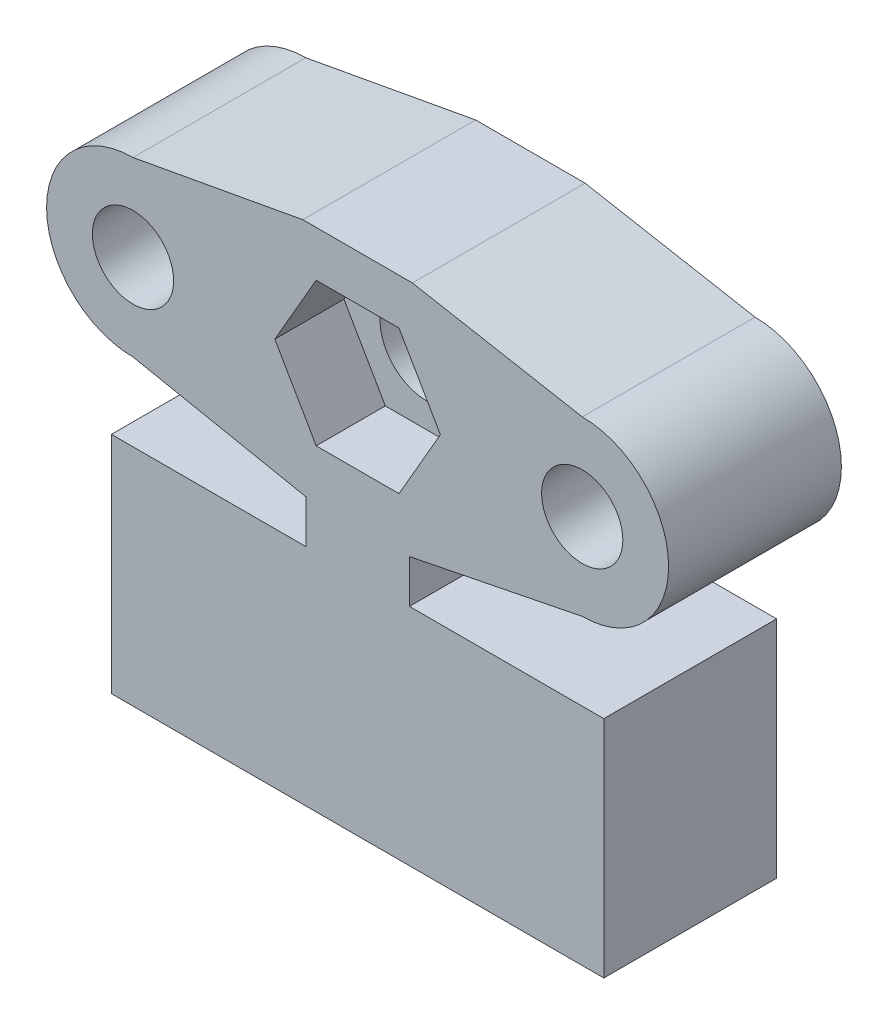
ISO-10303-21;
HEADER;
FILE_DESCRIPTION(('STEP AP214'),'2;1');
FILE_NAME('part.step','',(''),(''),'','','');
FILE_SCHEMA(('AUTOMOTIVE_DESIGN { 1 0 10303 214 1 1 1 1 }'));
ENDSEC;
DATA;
#1=APPLICATION_CONTEXT('core data for automotive mechanical design processes');
#2=APPLICATION_PROTOCOL_DEFINITION('international standard','automotive_design',2000,#1);
#3=PRODUCT_CONTEXT('',#1,'mechanical');
#4=PRODUCT('Part','Part','',(#3));
#5=PRODUCT_RELATED_PRODUCT_CATEGORY('part','',(#4));
#6=PRODUCT_DEFINITION_FORMATION('','',#4);
#7=PRODUCT_DEFINITION_CONTEXT('part definition',#1,'design');
#8=PRODUCT_DEFINITION('design','',#6,#7);
#9=PRODUCT_DEFINITION_SHAPE('','',#8);
#10=(LENGTH_UNIT() NAMED_UNIT(*) SI_UNIT(.MILLI.,.METRE.));
#11=(NAMED_UNIT(*) PLANE_ANGLE_UNIT() SI_UNIT($,.RADIAN.));
#12=(NAMED_UNIT(*) SI_UNIT($,.STERADIAN.) SOLID_ANGLE_UNIT());
#13=UNCERTAINTY_MEASURE_WITH_UNIT(LENGTH_MEASURE(1.E-05),#10,'distance_accuracy_value','');
#14=(GEOMETRIC_REPRESENTATION_CONTEXT(3) GLOBAL_UNCERTAINTY_ASSIGNED_CONTEXT((#13)) GLOBAL_UNIT_ASSIGNED_CONTEXT((#10,
#11,#12)) REPRESENTATION_CONTEXT('',''));
#15=CARTESIAN_POINT('',(0.,0.,0.));
#16=DIRECTION('',(0.,0.,1.));
#17=DIRECTION('',(1.,0.,0.));
#18=AXIS2_PLACEMENT_3D('',#15,#16,#17);
#19=CARTESIAN_POINT('',(-1.61538461538462,8.07692307692307,10.));
#20=DIRECTION('',(-0.196116135138184,0.98058067569092,0.));
#21=DIRECTION('',(-0.98058067569092,-0.196116135138184,0.));
#22=AXIS2_PLACEMENT_3D('',#19,#20,#21);
#23=PLANE('',#22);
#24=DIRECTION('',(0.98058067569092,0.196116135138184,0.));
#25=VECTOR('',#24,1.);
#26=CARTESIAN_POINT('',(-1.61538461538462,8.07692307692307,0.));
#27=LINE('',#26,#25);
#28=CARTESIAN_POINT('',(2.99999999999999,9.,0.));
#29=VERTEX_POINT('',#28);
#30=CARTESIAN_POINT('',(13.,11.,0.));
#31=VERTEX_POINT('',#30);
#32=EDGE_CURVE('E271',#29,#31,#27,.T.);
#33=ORIENTED_EDGE('',*,*,#32,.T.);
#34=DIRECTION('',(0.,0.,-1.));
#35=VECTOR('',#34,1.);
#36=CARTESIAN_POINT('',(13.,11.,10.));
#37=LINE('',#36,#35);
#38=CARTESIAN_POINT('',(13.,11.,10.));
#39=VERTEX_POINT('',#38);
#40=EDGE_CURVE('E11',#39,#31,#37,.T.);
#41=ORIENTED_EDGE('',*,*,#40,.F.);
#42=DIRECTION('',(0.98058067569092,0.196116135138184,0.));
#43=VECTOR('',#42,1.);
#44=CARTESIAN_POINT('',(-1.61538461538462,8.07692307692307,10.));
#45=LINE('',#44,#43);
#46=CARTESIAN_POINT('',(2.99999999999999,9.,10.));
#47=VERTEX_POINT('',#46);
#48=EDGE_CURVE('E229',#47,#39,#45,.T.);
#49=ORIENTED_EDGE('',*,*,#48,.F.);
#50=DIRECTION('',(0.,0.,-1.));
#51=VECTOR('',#50,1.);
#52=CARTESIAN_POINT('',(2.99999999999999,9.,10.));
#53=LINE('',#52,#51);
#54=EDGE_CURVE('E310',#47,#29,#53,.T.);
#55=ORIENTED_EDGE('',*,*,#54,.T.);
#56=EDGE_LOOP('',(#33,#41,#49,#55));
#57=FACE_BOUND('',#56,.T.);
#58=ADVANCED_FACE('F32',(#57),#23,.F.);
#59=CARTESIAN_POINT('',(13.,16.,10.));
#60=DIRECTION('',(0.,0.,-1.));
#61=DIRECTION('',(-1.,0.,0.));
#62=AXIS2_PLACEMENT_3D('',#59,#60,#61);
#63=CYLINDRICAL_SURFACE('',#62,5.);
#64=CARTESIAN_POINT('',(13.,16.,0.));
#65=DIRECTION('',(0.,0.,1.));
#66=DIRECTION('',(1.,0.,0.));
#67=AXIS2_PLACEMENT_3D('',#64,#65,#66);
#68=CIRCLE('',#67,5.);
#69=CARTESIAN_POINT('',(13.,21.,0.));
#70=VERTEX_POINT('',#69);
#71=EDGE_CURVE('E274',#31,#70,#68,.T.);
#72=ORIENTED_EDGE('',*,*,#71,.T.);
#73=DIRECTION('',(0.,0.,-1.));
#74=VECTOR('',#73,1.);
#75=CARTESIAN_POINT('',(13.,21.,10.));
#76=LINE('',#75,#74);
#77=CARTESIAN_POINT('',(13.,21.,10.));
#78=VERTEX_POINT('',#77);
#79=EDGE_CURVE('E41',#78,#70,#76,.T.);
#80=ORIENTED_EDGE('',*,*,#79,.F.);
#81=CARTESIAN_POINT('',(13.,16.,10.));
#82=DIRECTION('',(0.,0.,1.));
#83=DIRECTION('',(1.,0.,0.));
#84=AXIS2_PLACEMENT_3D('',#81,#82,#83);
#85=CIRCLE('',#84,5.);
#86=EDGE_CURVE('E232',#39,#78,#85,.T.);
#87=ORIENTED_EDGE('',*,*,#86,.F.);
#88=ORIENTED_EDGE('',*,*,#40,.T.);
#89=EDGE_LOOP('',(#72,#80,#87,#88));
#90=FACE_BOUND('',#89,.T.);
#91=ADVANCED_FACE('F431',(#90),#63,.T.);
#92=CARTESIAN_POINT('',(4.13578931132476,22.620664495792,10.));
#93=DIRECTION('',(0.179851061494331,0.983693852618467,0.));
#94=DIRECTION('',(-0.983693852618467,0.179851061494331,0.));
#95=AXIS2_PLACEMENT_3D('',#92,#93,#94);
#96=PLANE('',#95);
#97=DIRECTION('',(0.983693852618467,-0.179851061494331,0.));
#98=VECTOR('',#97,1.);
#99=CARTESIAN_POINT('',(4.13578931132476,22.620664495792,0.));
#100=LINE('',#99,#98);
#101=CARTESIAN_POINT('',(3.16963696305526,22.7973084027749,0.));
#102=VERTEX_POINT('',#101);
#103=EDGE_CURVE('E277',#102,#70,#100,.T.);
#104=ORIENTED_EDGE('',*,*,#103,.F.);
#105=DIRECTION('',(0.,0.,-1.));
#106=VECTOR('',#105,1.);
#107=CARTESIAN_POINT('',(3.16963696305526,22.7973084027749,10.));
#108=LINE('',#107,#106);
#109=CARTESIAN_POINT('',(3.16963696305526,22.7973084027749,10.));
#110=VERTEX_POINT('',#109);
#111=EDGE_CURVE('E334',#110,#102,#108,.T.);
#112=ORIENTED_EDGE('',*,*,#111,.F.);
#113=DIRECTION('',(0.983693852618467,-0.179851061494331,0.));
#114=VECTOR('',#113,1.);
#115=CARTESIAN_POINT('',(4.13578931132476,22.620664495792,10.));
#116=LINE('',#115,#114);
#117=EDGE_CURVE('E234',#110,#78,#116,.T.);
#118=ORIENTED_EDGE('',*,*,#117,.T.);
#119=ORIENTED_EDGE('',*,*,#79,.T.);
#120=EDGE_LOOP('',(#104,#112,#118,#119));
#121=FACE_BOUND('',#120,.T.);
#122=ADVANCED_FACE('F427',(#121),#96,.T.);
#123=CARTESIAN_POINT('',(0.,22.7973084027749,10.));
#124=DIRECTION('',(0.,1.,0.));
#125=DIRECTION('',(0.,0.,1.));
#126=AXIS2_PLACEMENT_3D('',#123,#124,#125);
#127=PLANE('',#126);
#128=DIRECTION('',(1.,0.,0.));
#129=VECTOR('',#128,1.);
#130=CARTESIAN_POINT('',(0.,22.7973084027749,0.));
#131=LINE('',#130,#129);
#132=CARTESIAN_POINT('',(-3.16963696305526,22.7973084027749,0.));
#133=VERTEX_POINT('',#132);
#134=EDGE_CURVE('E280',#133,#102,#131,.T.);
#135=ORIENTED_EDGE('',*,*,#134,.F.);
#136=DIRECTION('',(0.,0.,-1.));
#137=VECTOR('',#136,1.);
#138=CARTESIAN_POINT('',(-3.16963696305526,22.7973084027749,10.));
#139=LINE('',#138,#137);
#140=CARTESIAN_POINT('',(-3.16963696305526,22.7973084027749,10.));
#141=VERTEX_POINT('',#140);
#142=EDGE_CURVE('E332',#141,#133,#139,.T.);
#143=ORIENTED_EDGE('',*,*,#142,.F.);
#144=DIRECTION('',(1.,0.,0.));
#145=VECTOR('',#144,1.);
#146=CARTESIAN_POINT('',(0.,22.7973084027749,10.));
#147=LINE('',#146,#145);
#148=EDGE_CURVE('E237',#141,#110,#147,.T.);
#149=ORIENTED_EDGE('',*,*,#148,.T.);
#150=ORIENTED_EDGE('',*,*,#111,.T.);
#151=EDGE_LOOP('',(#135,#143,#149,#150));
#152=FACE_BOUND('',#151,.T.);
#153=ADVANCED_FACE('F424',(#152),#127,.T.);
#154=CARTESIAN_POINT('',(-4.13578931132474,22.620664495792,10.));
#155=DIRECTION('',(-0.17985106149433,0.983693852618467,0.));
#156=DIRECTION('',(-0.983693852618467,-0.17985106149433,0.));
#157=AXIS2_PLACEMENT_3D('',#154,#155,#156);
#158=PLANE('',#157);
#159=DIRECTION('',(0.983693852618467,0.17985106149433,0.));
#160=VECTOR('',#159,1.);
#161=CARTESIAN_POINT('',(-4.13578931132474,22.620664495792,0.));
#162=LINE('',#161,#160);
#163=CARTESIAN_POINT('',(-13.,21.,0.));
#164=VERTEX_POINT('',#163);
#165=EDGE_CURVE('E283',#164,#133,#162,.T.);
#166=ORIENTED_EDGE('',*,*,#165,.F.);
#167=DIRECTION('',(0.,0.,-1.));
#168=VECTOR('',#167,1.);
#169=CARTESIAN_POINT('',(-13.,21.,10.));
#170=LINE('',#169,#168);
#171=CARTESIAN_POINT('',(-13.,21.,10.));
#172=VERTEX_POINT('',#171);
#173=EDGE_CURVE('E330',#172,#164,#170,.T.);
#174=ORIENTED_EDGE('',*,*,#173,.F.);
#175=DIRECTION('',(0.983693852618467,0.17985106149433,0.));
#176=VECTOR('',#175,1.);
#177=CARTESIAN_POINT('',(-4.13578931132474,22.620664495792,10.));
#178=LINE('',#177,#176);
#179=EDGE_CURVE('E240',#172,#141,#178,.T.);
#180=ORIENTED_EDGE('',*,*,#179,.T.);
#181=ORIENTED_EDGE('',*,*,#142,.T.);
#182=EDGE_LOOP('',(#166,#174,#180,#181));
#183=FACE_BOUND('',#182,.T.);
#184=ADVANCED_FACE('F418',(#183),#158,.T.);
#185=CARTESIAN_POINT('',(-13.,16.,10.));
#186=DIRECTION('',(0.,0.,-1.));
#187=DIRECTION('',(-1.,0.,0.));
#188=AXIS2_PLACEMENT_3D('',#185,#186,#187);
#189=CYLINDRICAL_SURFACE('',#188,5.);
#190=CARTESIAN_POINT('',(-13.,16.,0.));
#191=DIRECTION('',(0.,0.,1.));
#192=DIRECTION('',(1.,0.,0.));
#193=AXIS2_PLACEMENT_3D('',#190,#191,#192);
#194=CIRCLE('',#193,5.);
#195=CARTESIAN_POINT('',(-13.,11.,0.));
#196=VERTEX_POINT('',#195);
#197=EDGE_CURVE('E286',#164,#196,#194,.T.);
#198=ORIENTED_EDGE('',*,*,#197,.T.);
#199=DIRECTION('',(0.,0.,-1.));
#200=VECTOR('',#199,1.);
#201=CARTESIAN_POINT('',(-13.,11.,10.));
#202=LINE('',#201,#200);
#203=CARTESIAN_POINT('',(-13.,11.,10.));
#204=VERTEX_POINT('',#203);
#205=EDGE_CURVE('E328',#204,#196,#202,.T.);
#206=ORIENTED_EDGE('',*,*,#205,.F.);
#207=CARTESIAN_POINT('',(-13.,16.,10.));
#208=DIRECTION('',(0.,0.,1.));
#209=DIRECTION('',(1.,0.,0.));
#210=AXIS2_PLACEMENT_3D('',#207,#208,#209);
#211=CIRCLE('',#210,5.);
#212=EDGE_CURVE('E243',#172,#204,#211,.T.);
#213=ORIENTED_EDGE('',*,*,#212,.F.);
#214=ORIENTED_EDGE('',*,*,#173,.T.);
#215=EDGE_LOOP('',(#198,#206,#213,#214));
#216=FACE_BOUND('',#215,.T.);
#217=ADVANCED_FACE('F492',(#216),#189,.T.);
#218=CARTESIAN_POINT('',(1.61538461538462,8.07692307692307,10.));
#219=DIRECTION('',(-0.196116135138184,-0.98058067569092,0.));
#220=DIRECTION('',(0.98058067569092,-0.196116135138184,0.));
#221=AXIS2_PLACEMENT_3D('',#218,#219,#220);
#222=PLANE('',#221);
#223=DIRECTION('',(-0.98058067569092,0.196116135138184,0.));
#224=VECTOR('',#223,1.);
#225=CARTESIAN_POINT('',(1.61538461538462,8.07692307692307,0.));
#226=LINE('',#225,#224);
#227=CARTESIAN_POINT('',(-3.00000000000001,9.,0.));
#228=VERTEX_POINT('',#227);
#229=EDGE_CURVE('E289',#228,#196,#226,.T.);
#230=ORIENTED_EDGE('',*,*,#229,.F.);
#231=DIRECTION('',(0.,0.,-1.));
#232=VECTOR('',#231,1.);
#233=CARTESIAN_POINT('',(-3.00000000000001,9.,10.));
#234=LINE('',#233,#232);
#235=CARTESIAN_POINT('',(-3.00000000000001,9.,10.));
#236=VERTEX_POINT('',#235);
#237=EDGE_CURVE('E326',#236,#228,#234,.T.);
#238=ORIENTED_EDGE('',*,*,#237,.F.);
#239=DIRECTION('',(-0.98058067569092,0.196116135138184,0.));
#240=VECTOR('',#239,1.);
#241=CARTESIAN_POINT('',(1.61538461538462,8.07692307692307,10.));
#242=LINE('',#241,#240);
#243=EDGE_CURVE('E245',#236,#204,#242,.T.);
#244=ORIENTED_EDGE('',*,*,#243,.T.);
#245=ORIENTED_EDGE('',*,*,#205,.T.);
#246=EDGE_LOOP('',(#230,#238,#244,#245));
#247=FACE_BOUND('',#246,.T.);
#248=ADVANCED_FACE('F412',(#247),#222,.T.);
#249=CARTESIAN_POINT('',(-3.00000000000001,0.,10.));
#250=DIRECTION('',(-1.,0.,0.));
#251=DIRECTION('',(0.,0.,1.));
#252=AXIS2_PLACEMENT_3D('',#249,#250,#251);
#253=PLANE('',#252);
#254=DIRECTION('',(0.,1.,0.));
#255=VECTOR('',#254,1.);
#256=CARTESIAN_POINT('',(-3.00000000000001,0.,0.));
#257=LINE('',#256,#255);
#258=CARTESIAN_POINT('',(-3.00000000000001,6.5,0.));
#259=VERTEX_POINT('',#258);
#260=EDGE_CURVE('E292',#259,#228,#257,.T.);
#261=ORIENTED_EDGE('',*,*,#260,.F.);
#262=DIRECTION('',(0.,0.,-1.));
#263=VECTOR('',#262,1.);
#264=CARTESIAN_POINT('',(-3.00000000000001,6.5,10.));
#265=LINE('',#264,#263);
#266=CARTESIAN_POINT('',(-3.00000000000001,6.5,10.));
#267=VERTEX_POINT('',#266);
#268=EDGE_CURVE('E324',#267,#259,#265,.T.);
#269=ORIENTED_EDGE('',*,*,#268,.F.);
#270=DIRECTION('',(0.,1.,0.));
#271=VECTOR('',#270,1.);
#272=CARTESIAN_POINT('',(-3.00000000000001,0.,10.));
#273=LINE('',#272,#271);
#274=EDGE_CURVE('E248',#267,#236,#273,.T.);
#275=ORIENTED_EDGE('',*,*,#274,.T.);
#276=ORIENTED_EDGE('',*,*,#237,.T.);
#277=EDGE_LOOP('',(#261,#269,#275,#276));
#278=FACE_BOUND('',#277,.T.);
#279=ADVANCED_FACE('F408',(#278),#253,.T.);
#280=CARTESIAN_POINT('',(0.,6.5,10.));
#281=DIRECTION('',(0.,1.,0.));
#282=DIRECTION('',(0.,0.,1.));
#283=AXIS2_PLACEMENT_3D('',#280,#281,#282);
#284=PLANE('',#283);
#285=DIRECTION('',(1.,0.,0.));
#286=VECTOR('',#285,1.);
#287=CARTESIAN_POINT('',(0.,6.5,0.));
#288=LINE('',#287,#286);
#289=CARTESIAN_POINT('',(-14.25,6.5,0.));
#290=VERTEX_POINT('',#289);
#291=EDGE_CURVE('E295',#290,#259,#288,.T.);
#292=ORIENTED_EDGE('',*,*,#291,.F.);
#293=DIRECTION('',(0.,0.,-1.));
#294=VECTOR('',#293,1.);
#295=CARTESIAN_POINT('',(-14.25,6.5,10.));
#296=LINE('',#295,#294);
#297=CARTESIAN_POINT('',(-14.25,6.5,10.));
#298=VERTEX_POINT('',#297);
#299=EDGE_CURVE('E322',#298,#290,#296,.T.);
#300=ORIENTED_EDGE('',*,*,#299,.F.);
#301=DIRECTION('',(1.,0.,0.));
#302=VECTOR('',#301,1.);
#303=CARTESIAN_POINT('',(0.,6.5,10.));
#304=LINE('',#303,#302);
#305=EDGE_CURVE('E251',#298,#267,#304,.T.);
#306=ORIENTED_EDGE('',*,*,#305,.T.);
#307=ORIENTED_EDGE('',*,*,#268,.T.);
#308=EDGE_LOOP('',(#292,#300,#306,#307));
#309=FACE_BOUND('',#308,.T.);
#310=ADVANCED_FACE('F406',(#309),#284,.T.);
#311=CARTESIAN_POINT('',(-14.25,0.,10.));
#312=DIRECTION('',(-1.,0.,0.));
#313=DIRECTION('',(0.,0.,1.));
#314=AXIS2_PLACEMENT_3D('',#311,#312,#313);
#315=PLANE('',#314);
#316=DIRECTION('',(0.,1.,0.));
#317=VECTOR('',#316,1.);
#318=CARTESIAN_POINT('',(-14.25,0.,0.));
#319=LINE('',#318,#317);
#320=CARTESIAN_POINT('',(-14.25,-6.5,0.));
#321=VERTEX_POINT('',#320);
#322=EDGE_CURVE('E298',#321,#290,#319,.T.);
#323=ORIENTED_EDGE('',*,*,#322,.F.);
#324=DIRECTION('',(0.,0.,-1.));
#325=VECTOR('',#324,1.);
#326=CARTESIAN_POINT('',(-14.25,-6.5,10.));
#327=LINE('',#326,#325);
#328=CARTESIAN_POINT('',(-14.25,-6.5,10.));
#329=VERTEX_POINT('',#328);
#330=EDGE_CURVE('E320',#329,#321,#327,.T.);
#331=ORIENTED_EDGE('',*,*,#330,.F.);
#332=DIRECTION('',(0.,1.,0.));
#333=VECTOR('',#332,1.);
#334=CARTESIAN_POINT('',(-14.25,0.,10.));
#335=LINE('',#334,#333);
#336=EDGE_CURVE('E254',#329,#298,#335,.T.);
#337=ORIENTED_EDGE('',*,*,#336,.T.);
#338=ORIENTED_EDGE('',*,*,#299,.T.);
#339=EDGE_LOOP('',(#323,#331,#337,#338));
#340=FACE_BOUND('',#339,.T.);
#341=ADVANCED_FACE('F374',(#340),#315,.T.);
#342=CARTESIAN_POINT('',(0.,-6.5,10.));
#343=DIRECTION('',(0.,1.,0.));
#344=DIRECTION('',(0.,0.,1.));
#345=AXIS2_PLACEMENT_3D('',#342,#343,#344);
#346=PLANE('',#345);
#347=CARTESIAN_POINT('',(0.449999999999987,-6.5,3.));
#348=DIRECTION('',(0.,-1.,0.));
#349=DIRECTION('',(0.,0.,-1.));
#350=AXIS2_PLACEMENT_3D('',#347,#348,#349);
#351=CIRCLE('',#350,0.85);
#352=CARTESIAN_POINT('',(0.449999999999987,-6.5,2.15));
#353=VERTEX_POINT('',#352);
#354=EDGE_CURVE('E355',#353,#353,#351,.T.);
#355=ORIENTED_EDGE('',*,*,#354,.F.);
#356=EDGE_LOOP('',(#355));
#357=FACE_BOUND('',#356,.T.);
#358=CARTESIAN_POINT('',(-9.25000000000001,-6.5,3.));
#359=DIRECTION('',(0.,-1.,0.));
#360=DIRECTION('',(0.,0.,-1.));
#361=AXIS2_PLACEMENT_3D('',#358,#359,#360);
#362=CIRCLE('',#361,0.85);
#363=CARTESIAN_POINT('',(-9.25000000000001,-6.5,2.15));
#364=VERTEX_POINT('',#363);
#365=EDGE_CURVE('E349',#364,#364,#362,.T.);
#366=ORIENTED_EDGE('',*,*,#365,.F.);
#367=EDGE_LOOP('',(#366));
#368=FACE_BOUND('',#367,.T.);
#369=DIRECTION('',(1.,0.,0.));
#370=VECTOR('',#369,1.);
#371=CARTESIAN_POINT('',(0.,-6.5,0.));
#372=LINE('',#371,#370);
#373=CARTESIAN_POINT('',(14.25,-6.5,0.));
#374=VERTEX_POINT('',#373);
#375=EDGE_CURVE('E301',#321,#374,#372,.T.);
#376=ORIENTED_EDGE('',*,*,#375,.T.);
#377=DIRECTION('',(0.,0.,-1.));
#378=VECTOR('',#377,1.);
#379=CARTESIAN_POINT('',(14.25,-6.5,10.));
#380=LINE('',#379,#378);
#381=CARTESIAN_POINT('',(14.25,-6.5,10.));
#382=VERTEX_POINT('',#381);
#383=EDGE_CURVE('E317',#382,#374,#380,.T.);
#384=ORIENTED_EDGE('',*,*,#383,.F.);
#385=DIRECTION('',(1.,0.,0.));
#386=VECTOR('',#385,1.);
#387=CARTESIAN_POINT('',(0.,-6.5,10.));
#388=LINE('',#387,#386);
#389=EDGE_CURVE('E257',#329,#382,#388,.T.);
#390=ORIENTED_EDGE('',*,*,#389,.F.);
#391=ORIENTED_EDGE('',*,*,#330,.T.);
#392=EDGE_LOOP('',(#376,#384,#390,#391));
#393=FACE_BOUND('',#392,.T.);
#394=ADVANCED_FACE('F370',(#357,#368,#393),#346,.F.);
#395=CARTESIAN_POINT('',(14.25,0.,10.));
#396=DIRECTION('',(-1.,0.,0.));
#397=DIRECTION('',(0.,0.,1.));
#398=AXIS2_PLACEMENT_3D('',#395,#396,#397);
#399=PLANE('',#398);
#400=DIRECTION('',(0.,1.,0.));
#401=VECTOR('',#400,1.);
#402=CARTESIAN_POINT('',(14.25,0.,0.));
#403=LINE('',#402,#401);
#404=CARTESIAN_POINT('',(14.25,6.5,0.));
#405=VERTEX_POINT('',#404);
#406=EDGE_CURVE('E303',#374,#405,#403,.T.);
#407=ORIENTED_EDGE('',*,*,#406,.T.);
#408=DIRECTION('',(0.,0.,-1.));
#409=VECTOR('',#408,1.);
#410=CARTESIAN_POINT('',(14.25,6.5,10.));
#411=LINE('',#410,#409);
#412=CARTESIAN_POINT('',(14.25,6.5,10.));
#413=VERTEX_POINT('',#412);
#414=EDGE_CURVE('E315',#413,#405,#411,.T.);
#415=ORIENTED_EDGE('',*,*,#414,.F.);
#416=DIRECTION('',(0.,1.,0.));
#417=VECTOR('',#416,1.);
#418=CARTESIAN_POINT('',(14.25,0.,10.));
#419=LINE('',#418,#417);
#420=EDGE_CURVE('E259',#382,#413,#419,.T.);
#421=ORIENTED_EDGE('',*,*,#420,.F.);
#422=ORIENTED_EDGE('',*,*,#383,.T.);
#423=EDGE_LOOP('',(#407,#415,#421,#422));
#424=FACE_BOUND('',#423,.T.);
#425=ADVANCED_FACE('F373',(#424),#399,.F.);
#426=CARTESIAN_POINT('',(0.,6.5,10.));
#427=DIRECTION('',(0.,1.,0.));
#428=DIRECTION('',(0.,0.,1.));
#429=AXIS2_PLACEMENT_3D('',#426,#427,#428);
#430=PLANE('',#429);
#431=DIRECTION('',(1.,0.,0.));
#432=VECTOR('',#431,1.);
#433=CARTESIAN_POINT('',(0.,6.5,0.));
#434=LINE('',#433,#432);
#435=CARTESIAN_POINT('',(2.99999999999999,6.5,0.));
#436=VERTEX_POINT('',#435);
#437=EDGE_CURVE('E306',#436,#405,#434,.T.);
#438=ORIENTED_EDGE('',*,*,#437,.F.);
#439=DIRECTION('',(0.,0.,-1.));
#440=VECTOR('',#439,1.);
#441=CARTESIAN_POINT('',(2.99999999999999,6.5,10.));
#442=LINE('',#441,#440);
#443=CARTESIAN_POINT('',(2.99999999999999,6.5,10.));
#444=VERTEX_POINT('',#443);
#445=EDGE_CURVE('E313',#444,#436,#442,.T.);
#446=ORIENTED_EDGE('',*,*,#445,.F.);
#447=DIRECTION('',(1.,0.,0.));
#448=VECTOR('',#447,1.);
#449=CARTESIAN_POINT('',(0.,6.5,10.));
#450=LINE('',#449,#448);
#451=EDGE_CURVE('E261',#444,#413,#450,.T.);
#452=ORIENTED_EDGE('',*,*,#451,.T.);
#453=ORIENTED_EDGE('',*,*,#414,.T.);
#454=EDGE_LOOP('',(#438,#446,#452,#453));
#455=FACE_BOUND('',#454,.T.);
#456=ADVANCED_FACE('F393',(#455),#430,.T.);
#457=CARTESIAN_POINT('',(6.9064841137366E-13,11.85,10.));
#458=DIRECTION('',(0.,1.,0.));
#459=DIRECTION('',(-1.,0.,0.));
#460=AXIS2_PLACEMENT_3D('',#457,#458,#459);
#461=PLANE('',#460);
#462=DIRECTION('',(1.,0.,0.));
#463=VECTOR('',#462,1.);
#464=CARTESIAN_POINT('',(6.9064841137366E-13,11.85,6.));
#465=LINE('',#464,#463);
#466=CARTESIAN_POINT('',(-2.3960036171372,11.8500000000001,6.));
#467=VERTEX_POINT('',#466);
#468=CARTESIAN_POINT('',(2.39600361713669,11.8499999999999,6.));
#469=VERTEX_POINT('',#468);
#470=EDGE_CURVE('E49',#467,#469,#465,.T.);
#471=ORIENTED_EDGE('',*,*,#470,.F.);
#472=DIRECTION('',(0.,0.,-1.));
#473=VECTOR('',#472,1.);
#474=CARTESIAN_POINT('',(-2.3960036171372,11.8500000000001,10.));
#475=LINE('',#474,#473);
#476=CARTESIAN_POINT('',(-2.3960036171372,11.8500000000001,10.));
#477=VERTEX_POINT('',#476);
#478=EDGE_CURVE('E36',#477,#467,#475,.T.);
#479=ORIENTED_EDGE('',*,*,#478,.F.);
#480=DIRECTION('',(1.,0.,0.));
#481=VECTOR('',#480,1.);
#482=CARTESIAN_POINT('',(6.9064841137366E-13,11.85,10.));
#483=LINE('',#482,#481);
#484=CARTESIAN_POINT('',(2.39600361713669,11.8499999999999,10.));
#485=VERTEX_POINT('',#484);
#486=EDGE_CURVE('E207',#477,#485,#483,.T.);
#487=ORIENTED_EDGE('',*,*,#486,.T.);
#488=DIRECTION('',(0.,0.,-1.));
#489=VECTOR('',#488,1.);
#490=CARTESIAN_POINT('',(2.39600361713669,11.8499999999999,10.));
#491=LINE('',#490,#489);
#492=EDGE_CURVE('E182',#485,#469,#491,.T.);
#493=ORIENTED_EDGE('',*,*,#492,.T.);
#494=EDGE_LOOP('',(#471,#479,#487,#493));
#495=FACE_BOUND('',#494,.T.);
#496=ADVANCED_FACE('F34',(#495),#461,.T.);
#497=CARTESIAN_POINT('',(3.33419780456949,1.9249999999994,10.));
#498=DIRECTION('',(0.866025403784468,0.49999999999995,0.));
#499=DIRECTION('',(-0.49999999999995,0.866025403784468,0.));
#500=AXIS2_PLACEMENT_3D('',#497,#498,#499);
#501=PLANE('',#500);
#502=DIRECTION('',(0.49999999999995,-0.866025403784468,0.));
#503=VECTOR('',#502,1.);
#504=CARTESIAN_POINT('',(3.33419780456949,1.9249999999994,6.));
#505=LINE('',#504,#503);
#506=CARTESIAN_POINT('',(-4.7920072342739,16.0000000000003,6.));
#507=VERTEX_POINT('',#506);
#508=EDGE_CURVE('E56',#507,#467,#505,.T.);
#509=ORIENTED_EDGE('',*,*,#508,.F.);
#510=DIRECTION('',(0.,0.,-1.));
#511=VECTOR('',#510,1.);
#512=CARTESIAN_POINT('',(-4.7920072342739,16.0000000000003,10.));
#513=LINE('',#512,#511);
#514=CARTESIAN_POINT('',(-4.7920072342739,16.0000000000003,10.));
#515=VERTEX_POINT('',#514);
#516=EDGE_CURVE('E341',#515,#507,#513,.T.);
#517=ORIENTED_EDGE('',*,*,#516,.F.);
#518=DIRECTION('',(0.49999999999995,-0.866025403784468,0.));
#519=VECTOR('',#518,1.);
#520=CARTESIAN_POINT('',(3.33419780456949,1.9249999999994,10.));
#521=LINE('',#520,#519);
#522=EDGE_CURVE('E210',#515,#477,#521,.T.);
#523=ORIENTED_EDGE('',*,*,#522,.T.);
#524=ORIENTED_EDGE('',*,*,#478,.T.);
#525=EDGE_LOOP('',(#509,#517,#523,#524));
#526=FACE_BOUND('',#525,.T.);
#527=ADVANCED_FACE('F343',(#526),#501,.T.);
#528=CARTESIAN_POINT('',(-10.5222086559813,6.07500000000101,10.));
#529=DIRECTION('',(0.86602540378441,-0.50000000000005,0.));
#530=DIRECTION('',(0.50000000000005,0.86602540378441,0.));
#531=AXIS2_PLACEMENT_3D('',#528,#529,#530);
#532=PLANE('',#531);
#533=DIRECTION('',(-0.50000000000005,-0.86602540378441,0.));
#534=VECTOR('',#533,1.);
#535=CARTESIAN_POINT('',(-10.5222086559813,6.07500000000101,6.));
#536=LINE('',#535,#534);
#537=CARTESIAN_POINT('',(-2.39600361713671,20.1500000000001,6.));
#538=VERTEX_POINT('',#537);
#539=EDGE_CURVE('E198',#538,#507,#536,.T.);
#540=ORIENTED_EDGE('',*,*,#539,.F.);
#541=DIRECTION('',(0.,0.,-1.));
#542=VECTOR('',#541,1.);
#543=CARTESIAN_POINT('',(-2.39600361713671,20.1500000000001,10.));
#544=LINE('',#543,#542);
#545=CARTESIAN_POINT('',(-2.39600361713671,20.1500000000001,10.));
#546=VERTEX_POINT('',#545);
#547=EDGE_CURVE('E339',#546,#538,#544,.T.);
#548=ORIENTED_EDGE('',*,*,#547,.F.);
#549=DIRECTION('',(-0.50000000000005,-0.86602540378441,0.));
#550=VECTOR('',#549,1.);
#551=CARTESIAN_POINT('',(-10.5222086559813,6.07500000000101,10.));
#552=LINE('',#551,#550);
#553=EDGE_CURVE('E214',#546,#515,#552,.T.);
#554=ORIENTED_EDGE('',*,*,#553,.T.);
#555=ORIENTED_EDGE('',*,*,#516,.T.);
#556=EDGE_LOOP('',(#540,#548,#554,#555));
#557=FACE_BOUND('',#556,.T.);
#558=ADVANCED_FACE('F469',(#557),#532,.T.);
#559=CARTESIAN_POINT('',(1.167099341284E-12,20.15,10.));
#560=DIRECTION('',(0.,-1.,0.));
#561=DIRECTION('',(1.,0.,0.));
#562=AXIS2_PLACEMENT_3D('',#559,#560,#561);
#563=PLANE('',#562);
#564=DIRECTION('',(-1.,0.,0.));
#565=VECTOR('',#564,1.);
#566=CARTESIAN_POINT('',(1.167099341284E-12,20.15,6.));
#567=LINE('',#566,#565);
#568=CARTESIAN_POINT('',(2.39600361713717,20.1499999999999,6.));
#569=VERTEX_POINT('',#568);
#570=EDGE_CURVE('E190',#569,#538,#567,.T.);
#571=ORIENTED_EDGE('',*,*,#570,.F.);
#572=DIRECTION('',(0.,0.,-1.));
#573=VECTOR('',#572,1.);
#574=CARTESIAN_POINT('',(2.39600361713717,20.1499999999999,10.));
#575=LINE('',#574,#573);
#576=CARTESIAN_POINT('',(2.39600361713717,20.1499999999999,10.));
#577=VERTEX_POINT('',#576);
#578=EDGE_CURVE('E181',#577,#569,#575,.T.);
#579=ORIENTED_EDGE('',*,*,#578,.F.);
#580=DIRECTION('',(-1.,0.,0.));
#581=VECTOR('',#580,1.);
#582=CARTESIAN_POINT('',(1.167099341284E-12,20.15,10.));
#583=LINE('',#582,#581);
#584=EDGE_CURVE('E217',#577,#546,#583,.T.);
#585=ORIENTED_EDGE('',*,*,#584,.T.);
#586=ORIENTED_EDGE('',*,*,#547,.T.);
#587=EDGE_LOOP('',(#571,#579,#585,#586));
#588=FACE_BOUND('',#587,.T.);
#589=ADVANCED_FACE('F466',(#588),#563,.T.);
#590=CARTESIAN_POINT('',(10.5222086559806,6.07499999999899,10.));
#591=DIRECTION('',(-0.866025403784468,-0.49999999999995,0.));
#592=DIRECTION('',(0.49999999999995,-0.866025403784468,0.));
#593=AXIS2_PLACEMENT_3D('',#590,#591,#592);
#594=PLANE('',#593);
#595=DIRECTION('',(-0.49999999999995,0.866025403784468,0.));
#596=VECTOR('',#595,1.);
#597=CARTESIAN_POINT('',(10.5222086559806,6.07499999999899,6.));
#598=LINE('',#597,#596);
#599=CARTESIAN_POINT('',(4.79200723427388,15.9999999999997,6.));
#600=VERTEX_POINT('',#599);
#601=EDGE_CURVE('E186',#600,#569,#598,.T.);
#602=ORIENTED_EDGE('',*,*,#601,.F.);
#603=DIRECTION('',(0.,0.,-1.));
#604=VECTOR('',#603,1.);
#605=CARTESIAN_POINT('',(4.79200723427388,15.9999999999997,10.));
#606=LINE('',#605,#604);
#607=CARTESIAN_POINT('',(4.79200723427388,15.9999999999997,10.));
#608=VERTEX_POINT('',#607);
#609=EDGE_CURVE('E171',#608,#600,#606,.T.);
#610=ORIENTED_EDGE('',*,*,#609,.F.);
#611=DIRECTION('',(-0.49999999999995,0.866025403784468,0.));
#612=VECTOR('',#611,1.);
#613=CARTESIAN_POINT('',(10.5222086559806,6.07499999999899,10.));
#614=LINE('',#613,#612);
#615=EDGE_CURVE('E220',#608,#577,#614,.T.);
#616=ORIENTED_EDGE('',*,*,#615,.T.);
#617=ORIENTED_EDGE('',*,*,#578,.T.);
#618=EDGE_LOOP('',(#602,#610,#616,#617));
#619=FACE_BOUND('',#618,.T.);
#620=ADVANCED_FACE('F187',(#619),#594,.T.);
#621=CARTESIAN_POINT('',(13.,16.,10.));
#622=DIRECTION('',(0.,0.,-1.));
#623=DIRECTION('',(-1.,0.,0.));
#624=AXIS2_PLACEMENT_3D('',#621,#622,#623);
#625=CYLINDRICAL_SURFACE('',#624,2.35);
#626=CARTESIAN_POINT('',(13.,16.,10.));
#627=DIRECTION('',(0.,0.,1.));
#628=DIRECTION('',(1.,0.,0.));
#629=AXIS2_PLACEMENT_3D('',#626,#627,#628);
#630=CIRCLE('',#629,2.35);
#631=CARTESIAN_POINT('',(15.35,16.,10.));
#632=VERTEX_POINT('',#631);
#633=EDGE_CURVE('E226',#632,#632,#630,.T.);
#634=ORIENTED_EDGE('',*,*,#633,.T.);
#635=EDGE_LOOP('',(#634));
#636=FACE_BOUND('',#635,.T.);
#637=CARTESIAN_POINT('',(13.,16.,0.));
#638=DIRECTION('',(0.,0.,1.));
#639=DIRECTION('',(1.,0.,0.));
#640=AXIS2_PLACEMENT_3D('',#637,#638,#639);
#641=CIRCLE('',#640,2.35);
#642=CARTESIAN_POINT('',(15.35,16.,0.));
#643=VERTEX_POINT('',#642);
#644=EDGE_CURVE('E268',#643,#643,#641,.T.);
#645=ORIENTED_EDGE('',*,*,#644,.F.);
#646=EDGE_LOOP('',(#645));
#647=FACE_BOUND('',#646,.T.);
#648=ADVANCED_FACE('F457',(#636,#647),#625,.F.);
#649=CARTESIAN_POINT('',(-13.,16.,10.));
#650=DIRECTION('',(0.,0.,-1.));
#651=DIRECTION('',(-1.,0.,0.));
#652=AXIS2_PLACEMENT_3D('',#649,#650,#651);
#653=CYLINDRICAL_SURFACE('',#652,2.35);
#654=CARTESIAN_POINT('',(-13.,16.,10.));
#655=DIRECTION('',(0.,0.,1.));
#656=DIRECTION('',(1.,0.,0.));
#657=AXIS2_PLACEMENT_3D('',#654,#655,#656);
#658=CIRCLE('',#657,2.35);
#659=CARTESIAN_POINT('',(-10.65,16.,10.));
#660=VERTEX_POINT('',#659);
#661=EDGE_CURVE('E223',#660,#660,#658,.T.);
#662=ORIENTED_EDGE('',*,*,#661,.T.);
#663=EDGE_LOOP('',(#662));
#664=FACE_BOUND('',#663,.T.);
#665=CARTESIAN_POINT('',(-13.,16.,0.));
#666=DIRECTION('',(0.,0.,1.));
#667=DIRECTION('',(1.,0.,0.));
#668=AXIS2_PLACEMENT_3D('',#665,#666,#667);
#669=CIRCLE('',#668,2.35);
#670=CARTESIAN_POINT('',(-10.65,16.,0.));
#671=VERTEX_POINT('',#670);
#672=EDGE_CURVE('E201',#671,#671,#669,.T.);
#673=ORIENTED_EDGE('',*,*,#672,.F.);
#674=EDGE_LOOP('',(#673));
#675=FACE_BOUND('',#674,.T.);
#676=ADVANCED_FACE('F445',(#664,#675),#653,.F.);
#677=CARTESIAN_POINT('',(-3.33419780457068,1.9250000000006,10.));
#678=DIRECTION('',(-0.86602540378441,0.50000000000005,0.));
#679=DIRECTION('',(-0.50000000000005,-0.86602540378441,0.));
#680=AXIS2_PLACEMENT_3D('',#677,#678,#679);
#681=PLANE('',#680);
#682=DIRECTION('',(0.50000000000005,0.86602540378441,0.));
#683=VECTOR('',#682,1.);
#684=CARTESIAN_POINT('',(-3.33419780457068,1.9250000000006,6.));
#685=LINE('',#684,#683);
#686=EDGE_CURVE('E175',#469,#600,#685,.T.);
#687=ORIENTED_EDGE('',*,*,#686,.F.);
#688=ORIENTED_EDGE('',*,*,#492,.F.);
#689=DIRECTION('',(0.50000000000005,0.86602540378441,0.));
#690=VECTOR('',#689,1.);
#691=CARTESIAN_POINT('',(-3.33419780457068,1.9250000000006,10.));
#692=LINE('',#691,#690);
#693=EDGE_CURVE('E177',#485,#608,#692,.T.);
#694=ORIENTED_EDGE('',*,*,#693,.T.);
#695=ORIENTED_EDGE('',*,*,#609,.T.);
#696=EDGE_LOOP('',(#687,#688,#694,#695));
#697=FACE_BOUND('',#696,.T.);
#698=ADVANCED_FACE('F173',(#697),#681,.T.);
#699=CARTESIAN_POINT('',(2.99999999999999,0.,10.));
#700=DIRECTION('',(-1.,0.,0.));
#701=DIRECTION('',(0.,0.,1.));
#702=AXIS2_PLACEMENT_3D('',#699,#700,#701);
#703=PLANE('',#702);
#704=DIRECTION('',(0.,1.,0.));
#705=VECTOR('',#704,1.);
#706=CARTESIAN_POINT('',(2.99999999999999,0.,0.));
#707=LINE('',#706,#705);
#708=EDGE_CURVE('E211',#436,#29,#707,.T.);
#709=ORIENTED_EDGE('',*,*,#708,.T.);
#710=ORIENTED_EDGE('',*,*,#54,.F.);
#711=DIRECTION('',(0.,1.,0.));
#712=VECTOR('',#711,1.);
#713=CARTESIAN_POINT('',(2.99999999999999,0.,10.));
#714=LINE('',#713,#712);
#715=EDGE_CURVE('E264',#444,#47,#714,.T.);
#716=ORIENTED_EDGE('',*,*,#715,.F.);
#717=ORIENTED_EDGE('',*,*,#445,.T.);
#718=EDGE_LOOP('',(#709,#710,#716,#717));
#719=FACE_BOUND('',#718,.T.);
#720=ADVANCED_FACE('F436',(#719),#703,.F.);
#721=CARTESIAN_POINT('',(0.,0.,10.));
#722=DIRECTION('',(0.,0.,1.));
#723=DIRECTION('',(1.,0.,0.));
#724=AXIS2_PLACEMENT_3D('',#721,#722,#723);
#725=PLANE('',#724);
#726=ORIENTED_EDGE('',*,*,#486,.F.);
#727=ORIENTED_EDGE('',*,*,#522,.F.);
#728=ORIENTED_EDGE('',*,*,#553,.F.);
#729=ORIENTED_EDGE('',*,*,#584,.F.);
#730=ORIENTED_EDGE('',*,*,#615,.F.);
#731=ORIENTED_EDGE('',*,*,#693,.F.);
#732=EDGE_LOOP('',(#726,#727,#728,#729,#730,#731));
#733=FACE_BOUND('',#732,.T.);
#734=ORIENTED_EDGE('',*,*,#661,.F.);
#735=EDGE_LOOP('',(#734));
#736=FACE_BOUND('',#735,.T.);
#737=ORIENTED_EDGE('',*,*,#633,.F.);
#738=EDGE_LOOP('',(#737));
#739=FACE_BOUND('',#738,.T.);
#740=ORIENTED_EDGE('',*,*,#48,.T.);
#741=ORIENTED_EDGE('',*,*,#86,.T.);
#742=ORIENTED_EDGE('',*,*,#117,.F.);
#743=ORIENTED_EDGE('',*,*,#148,.F.);
#744=ORIENTED_EDGE('',*,*,#179,.F.);
#745=ORIENTED_EDGE('',*,*,#212,.T.);
#746=ORIENTED_EDGE('',*,*,#243,.F.);
#747=ORIENTED_EDGE('',*,*,#274,.F.);
#748=ORIENTED_EDGE('',*,*,#305,.F.);
#749=ORIENTED_EDGE('',*,*,#336,.F.);
#750=ORIENTED_EDGE('',*,*,#389,.T.);
#751=ORIENTED_EDGE('',*,*,#420,.T.);
#752=ORIENTED_EDGE('',*,*,#451,.F.);
#753=ORIENTED_EDGE('',*,*,#715,.T.);
#754=EDGE_LOOP('',(#740,#741,#742,#743,#744,#745,#746,#747,#748,#749,#750,#751,#752,#753));
#755=FACE_BOUND('',#754,.T.);
#756=ADVANCED_FACE('F397',(#733,#736,#739,#755),#725,.T.);
#757=CARTESIAN_POINT('',(0.,0.,0.));
#758=DIRECTION('',(0.,0.,1.));
#759=DIRECTION('',(1.,0.,0.));
#760=AXIS2_PLACEMENT_3D('',#757,#758,#759);
#761=PLANE('',#760);
#762=ORIENTED_EDGE('',*,*,#672,.T.);
#763=EDGE_LOOP('',(#762));
#764=FACE_BOUND('',#763,.T.);
#765=ORIENTED_EDGE('',*,*,#644,.T.);
#766=EDGE_LOOP('',(#765));
#767=FACE_BOUND('',#766,.T.);
#768=ORIENTED_EDGE('',*,*,#32,.F.);
#769=ORIENTED_EDGE('',*,*,#708,.F.);
#770=ORIENTED_EDGE('',*,*,#437,.T.);
#771=ORIENTED_EDGE('',*,*,#406,.F.);
#772=ORIENTED_EDGE('',*,*,#375,.F.);
#773=ORIENTED_EDGE('',*,*,#322,.T.);
#774=ORIENTED_EDGE('',*,*,#291,.T.);
#775=ORIENTED_EDGE('',*,*,#260,.T.);
#776=ORIENTED_EDGE('',*,*,#229,.T.);
#777=ORIENTED_EDGE('',*,*,#197,.F.);
#778=ORIENTED_EDGE('',*,*,#165,.T.);
#779=ORIENTED_EDGE('',*,*,#134,.T.);
#780=ORIENTED_EDGE('',*,*,#103,.T.);
#781=ORIENTED_EDGE('',*,*,#71,.F.);
#782=EDGE_LOOP('',(#768,#769,#770,#771,#772,#773,#774,#775,#776,#777,#778,#779,#780,#781));
#783=FACE_BOUND('',#782,.T.);
#784=CARTESIAN_POINT('',(0.,16.,0.));
#785=DIRECTION('',(0.,0.,1.));
#786=DIRECTION('',(1.,0.,0.));
#787=AXIS2_PLACEMENT_3D('',#784,#785,#786);
#788=CIRCLE('',#787,2.7);
#789=CARTESIAN_POINT('',(2.69999999999999,16.,0.));
#790=VERTEX_POINT('',#789);
#791=EDGE_CURVE('E202',#790,#790,#788,.T.);
#792=ORIENTED_EDGE('',*,*,#791,.T.);
#793=EDGE_LOOP('',(#792));
#794=FACE_BOUND('',#793,.T.);
#795=ADVANCED_FACE('F388',(#764,#767,#783,#794),#761,.F.);
#796=CARTESIAN_POINT('',(0.,16.,6.));
#797=DIRECTION('',(0.,0.,-1.));
#798=DIRECTION('',(-1.,0.,0.));
#799=AXIS2_PLACEMENT_3D('',#796,#797,#798);
#800=CYLINDRICAL_SURFACE('',#799,2.7);
#801=CARTESIAN_POINT('',(0.,16.,6.));
#802=DIRECTION('',(0.,0.,1.));
#803=DIRECTION('',(1.,0.,0.));
#804=AXIS2_PLACEMENT_3D('',#801,#802,#803);
#805=CIRCLE('',#804,2.7);
#806=CARTESIAN_POINT('',(2.69999999999999,16.,6.));
#807=VERTEX_POINT('',#806);
#808=EDGE_CURVE('E205',#807,#807,#805,.T.);
#809=ORIENTED_EDGE('',*,*,#808,.T.);
#810=EDGE_LOOP('',(#809));
#811=FACE_BOUND('',#810,.T.);
#812=ORIENTED_EDGE('',*,*,#791,.F.);
#813=EDGE_LOOP('',(#812));
#814=FACE_BOUND('',#813,.T.);
#815=ADVANCED_FACE('F609',(#811,#814),#800,.F.);
#816=CARTESIAN_POINT('',(0.,0.,6.));
#817=DIRECTION('',(0.,0.,1.));
#818=DIRECTION('',(1.,0.,0.));
#819=AXIS2_PLACEMENT_3D('',#816,#817,#818);
#820=PLANE('',#819);
#821=ORIENTED_EDGE('',*,*,#808,.F.);
#822=EDGE_LOOP('',(#821));
#823=FACE_BOUND('',#822,.T.);
#824=ORIENTED_EDGE('',*,*,#508,.T.);
#825=ORIENTED_EDGE('',*,*,#470,.T.);
#826=ORIENTED_EDGE('',*,*,#686,.T.);
#827=ORIENTED_EDGE('',*,*,#601,.T.);
#828=ORIENTED_EDGE('',*,*,#570,.T.);
#829=ORIENTED_EDGE('',*,*,#539,.T.);
#830=EDGE_LOOP('',(#824,#825,#826,#827,#828,#829));
#831=FACE_BOUND('',#830,.T.);
#832=ADVANCED_FACE('F192',(#823,#831),#820,.T.);
#833=CARTESIAN_POINT('',(-9.25000000000001,1.5,3.));
#834=DIRECTION('',(0.,-1.,0.));
#835=DIRECTION('',(0.,0.,-1.));
#836=AXIS2_PLACEMENT_3D('',#833,#834,#835);
#837=CYLINDRICAL_SURFACE('',#836,0.85);
#838=CARTESIAN_POINT('',(-9.25000000000001,1.5,3.));
#839=DIRECTION('',(0.,-1.,0.));
#840=DIRECTION('',(0.,0.,-1.));
#841=AXIS2_PLACEMENT_3D('',#838,#839,#840);
#842=CIRCLE('',#841,0.85);
#843=CARTESIAN_POINT('',(-9.25000000000001,1.5,2.15));
#844=VERTEX_POINT('',#843);
#845=EDGE_CURVE('E206',#844,#844,#842,.T.);
#846=ORIENTED_EDGE('',*,*,#845,.F.);
#847=EDGE_LOOP('',(#846));
#848=FACE_BOUND('',#847,.T.);
#849=ORIENTED_EDGE('',*,*,#365,.T.);
#850=EDGE_LOOP('',(#849));
#851=FACE_BOUND('',#850,.T.);
#852=ADVANCED_FACE('F625',(#848,#851),#837,.F.);
#853=CARTESIAN_POINT('',(-9.25000000000001,1.5,3.));
#854=DIRECTION('',(0.,-1.,0.));
#855=DIRECTION('',(0.,0.,-1.));
#856=AXIS2_PLACEMENT_3D('',#853,#854,#855);
#857=PLANE('',#856);
#858=ORIENTED_EDGE('',*,*,#845,.T.);
#859=EDGE_LOOP('',(#858));
#860=FACE_BOUND('',#859,.T.);
#861=ADVANCED_FACE('F366',(#860),#857,.T.);
#862=CARTESIAN_POINT('',(0.449999999999987,1.5,3.));
#863=DIRECTION('',(0.,-1.,0.));
#864=DIRECTION('',(0.,0.,-1.));
#865=AXIS2_PLACEMENT_3D('',#862,#863,#864);
#866=CYLINDRICAL_SURFACE('',#865,0.85);
#867=CARTESIAN_POINT('',(0.449999999999987,1.5,3.));
#868=DIRECTION('',(0.,-1.,0.));
#869=DIRECTION('',(0.,0.,-1.));
#870=AXIS2_PLACEMENT_3D('',#867,#868,#869);
#871=CIRCLE('',#870,0.85);
#872=CARTESIAN_POINT('',(0.449999999999987,1.5,2.15));
#873=VERTEX_POINT('',#872);
#874=EDGE_CURVE('E352',#873,#873,#871,.T.);
#875=ORIENTED_EDGE('',*,*,#874,.F.);
#876=EDGE_LOOP('',(#875));
#877=FACE_BOUND('',#876,.T.);
#878=ORIENTED_EDGE('',*,*,#354,.T.);
#879=EDGE_LOOP('',(#878));
#880=FACE_BOUND('',#879,.T.);
#881=ADVANCED_FACE('F363',(#877,#880),#866,.F.);
#882=CARTESIAN_POINT('',(0.449999999999987,1.5,3.));
#883=DIRECTION('',(0.,-1.,0.));
#884=DIRECTION('',(0.,0.,-1.));
#885=AXIS2_PLACEMENT_3D('',#882,#883,#884);
#886=PLANE('',#885);
#887=ORIENTED_EDGE('',*,*,#874,.T.);
#888=EDGE_LOOP('',(#887));
#889=FACE_BOUND('',#888,.T.);
#890=ADVANCED_FACE('F361',(#889),#886,.T.);
#891=CLOSED_SHELL('',(#58,#91,#122,#153,#184,#217,#248,#279,#310,#341,#394,#425,#456,#496,#527,
#558,#589,#620,#648,#676,#698,#720,#756,#795,#815,#832,#852,#861,#881,#890));
#892=MANIFOLD_SOLID_BREP('B2',#891);
#893=ADVANCED_BREP_SHAPE_REPRESENTATION('',(#18,#892),#14);
#894=SHAPE_DEFINITION_REPRESENTATION(#9,#893);
ENDSEC;
END-ISO-10303-21;
